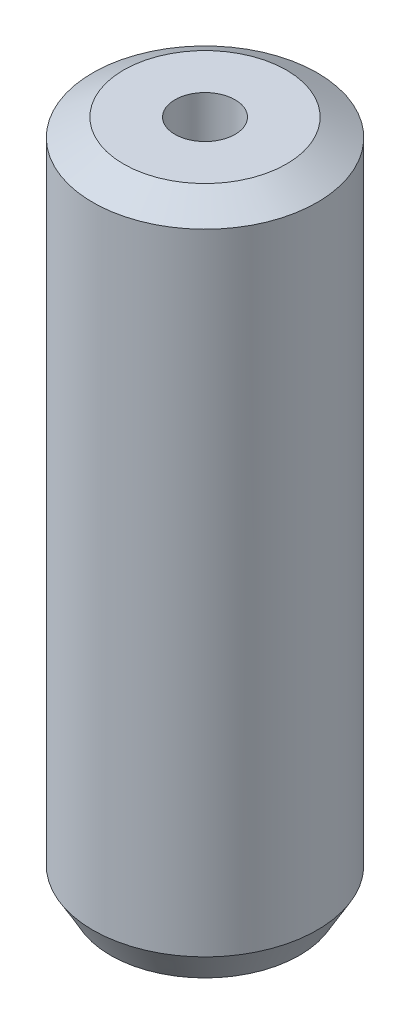
ISO-10303-21;
HEADER;
FILE_DESCRIPTION(('STEP AP214'),'2;1');
FILE_NAME('part.step','',(''),(''),'','','');
FILE_SCHEMA(('AUTOMOTIVE_DESIGN { 1 0 10303 214 1 1 1 1 }'));
ENDSEC;
DATA;
#1=APPLICATION_CONTEXT('core data for automotive mechanical design processes');
#2=APPLICATION_PROTOCOL_DEFINITION('international standard','automotive_design',2000,#1);
#3=PRODUCT_CONTEXT('',#1,'mechanical');
#4=PRODUCT('Part','Part','',(#3));
#5=PRODUCT_RELATED_PRODUCT_CATEGORY('part','',(#4));
#6=PRODUCT_DEFINITION_FORMATION('','',#4);
#7=PRODUCT_DEFINITION_CONTEXT('part definition',#1,'design');
#8=PRODUCT_DEFINITION('design','',#6,#7);
#9=PRODUCT_DEFINITION_SHAPE('','',#8);
#10=(LENGTH_UNIT() NAMED_UNIT(*) SI_UNIT(.MILLI.,.METRE.));
#11=(NAMED_UNIT(*) PLANE_ANGLE_UNIT() SI_UNIT($,.RADIAN.));
#12=(NAMED_UNIT(*) SI_UNIT($,.STERADIAN.) SOLID_ANGLE_UNIT());
#13=UNCERTAINTY_MEASURE_WITH_UNIT(LENGTH_MEASURE(1.E-05),#10,'distance_accuracy_value','');
#14=(GEOMETRIC_REPRESENTATION_CONTEXT(3) GLOBAL_UNCERTAINTY_ASSIGNED_CONTEXT((#13)) GLOBAL_UNIT_ASSIGNED_CONTEXT((#10,
#11,#12)) REPRESENTATION_CONTEXT('',''));
#15=CARTESIAN_POINT('',(0.,0.,0.));
#16=DIRECTION('',(0.,0.,1.));
#17=DIRECTION('',(1.,0.,0.));
#18=AXIS2_PLACEMENT_3D('',#15,#16,#17);
#19=CARTESIAN_POINT('',(0.,30.2308091959277,0.));
#20=DIRECTION('',(0.,-1.,0.));
#21=DIRECTION('',(0.,0.,-1.));
#22=AXIS2_PLACEMENT_3D('',#19,#20,#21);
#23=CYLINDRICAL_SURFACE('',#22,5.);
#24=CARTESIAN_POINT('',(0.,29.4384615355566,0.));
#25=DIRECTION('',(0.,1.,0.));
#26=DIRECTION('',(0.,0.,1.));
#27=AXIS2_PLACEMENT_3D('',#24,#25,#26);
#28=CIRCLE('',#27,5.);
#29=CARTESIAN_POINT('',(0.,29.4384615355566,-5.));
#30=VERTEX_POINT('',#29);
#31=EDGE_CURVE('E50',#30,#30,#28,.F.);
#32=CARTESIAN_POINT('',(0.,1.37238640502118,0.));
#33=DIRECTION('',(0.,1.,0.));
#34=DIRECTION('',(0.,0.,1.));
#35=AXIS2_PLACEMENT_3D('',#32,#33,#34);
#36=CIRCLE('',#35,5.);
#37=CARTESIAN_POINT('',(0.,1.37238640502117,-5.));
#38=VERTEX_POINT('',#37);
#39=EDGE_CURVE('E51',#38,#38,#36,.T.);
#40=CARTESIAN_POINT('',(0.,29.4384615355566,-5.));
#41=CARTESIAN_POINT('',(0.,29.1461065862801,-5.));
#42=CARTESIAN_POINT('',(0.,28.8537516370037,-5.));
#43=CARTESIAN_POINT('',(0.,28.2690417384509,-5.));
#44=CARTESIAN_POINT('',(0.,27.9766867891745,-5.));
#45=CARTESIAN_POINT('',(0.,27.3919768906217,-5.));
#46=CARTESIAN_POINT('',(0.,27.0996219413453,-5.));
#47=CARTESIAN_POINT('',(0.,26.5149120427925,-5.));
#48=CARTESIAN_POINT('',(0.,26.222557093516,-5.));
#49=CARTESIAN_POINT('',(0.,25.6378471949632,-5.));
#50=CARTESIAN_POINT('',(0.,25.3454922456868,-5.));
#51=CARTESIAN_POINT('',(0.,24.760782347134,-5.));
#52=CARTESIAN_POINT('',(0.,24.4684273978576,-5.));
#53=CARTESIAN_POINT('',(0.,23.8837174993048,-5.));
#54=CARTESIAN_POINT('',(0.,23.5913625500284,-5.));
#55=CARTESIAN_POINT('',(0.,23.0066526514755,-5.));
#56=CARTESIAN_POINT('',(0.,22.7142977021991,-5.));
#57=CARTESIAN_POINT('',(0.,22.1295878036463,-5.));
#58=CARTESIAN_POINT('',(0.,21.8372328543699,-5.));
#59=CARTESIAN_POINT('',(0.,21.2525229558171,-5.));
#60=CARTESIAN_POINT('',(0.,20.9601680065407,-5.));
#61=CARTESIAN_POINT('',(0.,20.3754581079878,-5.));
#62=CARTESIAN_POINT('',(0.,20.0831031587114,-5.));
#63=CARTESIAN_POINT('',(0.,19.4983932601586,-5.));
#64=CARTESIAN_POINT('',(0.,19.2060383108822,-5.));
#65=CARTESIAN_POINT('',(0.,18.6213284123294,-5.));
#66=CARTESIAN_POINT('',(0.,18.328973463053,-5.));
#67=CARTESIAN_POINT('',(0.,17.7442635645001,-5.));
#68=CARTESIAN_POINT('',(0.,17.4519086152237,-5.));
#69=CARTESIAN_POINT('',(0.,16.8671987166709,-5.));
#70=CARTESIAN_POINT('',(0.,16.5748437673945,-5.));
#71=CARTESIAN_POINT('',(0.,15.9901338688417,-5.));
#72=CARTESIAN_POINT('',(0.,15.6977789195653,-5.));
#73=CARTESIAN_POINT('',(0.,15.1130690210125,-5.));
#74=CARTESIAN_POINT('',(0.,14.820714071736,-5.));
#75=CARTESIAN_POINT('',(0.,14.2360041731832,-5.));
#76=CARTESIAN_POINT('',(0.,13.9436492239068,-5.));
#77=CARTESIAN_POINT('',(0.,13.358939325354,-5.));
#78=CARTESIAN_POINT('',(0.,13.0665843760776,-5.));
#79=CARTESIAN_POINT('',(0.,12.4818744775248,-5.));
#80=CARTESIAN_POINT('',(0.,12.1895195282484,-5.));
#81=CARTESIAN_POINT('',(0.,11.6048096296955,-5.));
#82=CARTESIAN_POINT('',(0.,11.3124546804191,-5.));
#83=CARTESIAN_POINT('',(0.,10.7277447818663,-5.));
#84=CARTESIAN_POINT('',(0.,10.4353898325899,-5.));
#85=CARTESIAN_POINT('',(0.,9.85067993403707,-5.));
#86=CARTESIAN_POINT('',(0.,9.55832498476066,-5.));
#87=CARTESIAN_POINT('',(0.,8.97361508620784,-5.));
#88=CARTESIAN_POINT('',(0.,8.68126013693143,-5.));
#89=CARTESIAN_POINT('',(0.,8.09655023837861,-5.));
#90=CARTESIAN_POINT('',(0.,7.8041952891022,-5.));
#91=CARTESIAN_POINT('',(0.,7.21948539054938,-5.));
#92=CARTESIAN_POINT('',(0.,6.92713044127297,-5.));
#93=CARTESIAN_POINT('',(0.,6.34242054272015,-5.));
#94=CARTESIAN_POINT('',(0.,6.05006559344374,-5.));
#95=CARTESIAN_POINT('',(0.,5.46535569489092,-5.));
#96=CARTESIAN_POINT('',(0.,5.17300074561451,-5.));
#97=CARTESIAN_POINT('',(0.,4.58829084706169,-5.));
#98=CARTESIAN_POINT('',(0.,4.29593589778527,-5.));
#99=CARTESIAN_POINT('',(0.,3.71122599923245,-5.));
#100=CARTESIAN_POINT('',(0.,3.41887104995604,-5.));
#101=CARTESIAN_POINT('',(0.,2.83416115140322,-5.));
#102=CARTESIAN_POINT('',(0.,2.54180620212681,-5.));
#103=CARTESIAN_POINT('',(0.,1.95709630357399,-5.));
#104=CARTESIAN_POINT('',(0.,1.66474135429758,-5.));
#105=CARTESIAN_POINT('',(0.,1.37238640502117,-5.));
#106=B_SPLINE_CURVE_WITH_KNOTS('',3,(#40,#41,#42,#43,#44,#45,#46,#47,#48,#49,#50,#51,#52,#53,
#54,#55,#56,#57,#58,#59,#60,#61,#62,#63,#64,#65,#66,#67,#68,#69,#70,#71,#72,#73,#74,#75,#76,#77,
#78,#79,#80,#81,#82,#83,#84,#85,#86,#87,#88,#89,#90,#91,#92,#93,#94,#95,#96,#97,#98,#99,#100,
#101,#102,#103,#104,#105),.UNSPECIFIED.,.F.,.F.,(4,2,2,2,2,2,2,2,2,2,2,2,2,2,2,2,2,2,2,2,2,2,2,
2,2,2,2,2,2,2,2,2,4),(0.,0.877064847829231,1.75412969565846,2.63119454348769,3.50825939131692,
4.38532423914615,5.26238908697538,6.13945393480461,7.01651878263384,7.89358363046307,
8.7706484782923,9.64771332612153,10.5247781739508,11.40184302178,12.2789078696092,
13.1559727174385,14.0330375652677,14.9101024130969,15.7871672609262,16.6642321087554,
17.5412969565846,18.4183618044138,19.2954266522431,20.1724915000723,21.0495563479015,
21.9266211957308,22.80368604356,23.6807508913892,24.5578157392185,25.4348805870477,
26.3119454348769,27.1890102827061,28.0660751305354),.UNSPECIFIED.);
#107=EDGE_CURVE('BSEAM39',#30,#38,#106,.T.);
#108=ORIENTED_EDGE('',*,*,#31,.T.);
#109=ORIENTED_EDGE('',*,*,#39,.T.);
#110=ORIENTED_EDGE('',*,*,#107,.T.);
#111=ORIENTED_EDGE('',*,*,#107,.F.);
#112=EDGE_LOOP('',(#108,#110,#109,#111));
#113=FACE_BOUND('',#112,.T.);
#114=ADVANCED_FACE('F39',(#113),#23,.T.);
#115=CARTESIAN_POINT('',(0.,30.2308091959277,0.));
#116=DIRECTION('',(0.,1.,0.));
#117=DIRECTION('',(0.,0.,1.));
#118=AXIS2_PLACEMENT_3D('',#115,#116,#117);
#119=PLANE('',#118);
#120=CARTESIAN_POINT('',(0.,30.2308091959277,0.));
#121=DIRECTION('',(0.,1.,0.));
#122=DIRECTION('',(0.,0.,1.));
#123=AXIS2_PLACEMENT_3D('',#120,#121,#122);
#124=CIRCLE('',#123,3.62761359497888);
#125=CARTESIAN_POINT('',(0.,30.2308091959277,3.62761359497888));
#126=VERTEX_POINT('',#125);
#127=EDGE_CURVE('E54',#126,#126,#124,.T.);
#128=ORIENTED_EDGE('',*,*,#127,.T.);
#129=EDGE_LOOP('',(#128));
#130=FACE_BOUND('',#129,.T.);
#131=CARTESIAN_POINT('',(0.,30.2308091959277,0.));
#132=DIRECTION('',(0.,1.,0.));
#133=DIRECTION('',(0.,0.,1.));
#134=AXIS2_PLACEMENT_3D('',#131,#132,#133);
#135=CIRCLE('',#134,1.33860655335828);
#136=CARTESIAN_POINT('',(0.,30.2308091959277,-1.33860655335828));
#137=VERTEX_POINT('',#136);
#138=EDGE_CURVE('E58',#137,#137,#135,.T.);
#139=ORIENTED_EDGE('',*,*,#138,.F.);
#140=EDGE_LOOP('',(#139));
#141=FACE_BOUND('',#140,.T.);
#142=ADVANCED_FACE('F69',(#130,#141),#119,.T.);
#143=CARTESIAN_POINT('',(0.,0.,0.));
#144=DIRECTION('',(0.,1.,0.));
#145=DIRECTION('',(0.,0.,1.));
#146=AXIS2_PLACEMENT_3D('',#143,#144,#145);
#147=PLANE('',#146);
#148=CARTESIAN_POINT('',(0.,0.,0.));
#149=DIRECTION('',(0.,1.,0.));
#150=DIRECTION('',(0.,0.,1.));
#151=AXIS2_PLACEMENT_3D('',#148,#149,#150);
#152=CIRCLE('',#151,4.20765233962883);
#153=CARTESIAN_POINT('',(0.,0.,4.20765233962883));
#154=VERTEX_POINT('',#153);
#155=EDGE_CURVE('E10',#154,#154,#152,.F.);
#156=ORIENTED_EDGE('',*,*,#155,.T.);
#157=EDGE_LOOP('',(#156));
#158=FACE_BOUND('',#157,.T.);
#159=CARTESIAN_POINT('',(0.,0.,0.));
#160=DIRECTION('',(0.,1.,0.));
#161=DIRECTION('',(0.,0.,1.));
#162=AXIS2_PLACEMENT_3D('',#159,#160,#161);
#163=CIRCLE('',#162,1.33860655335828);
#164=CARTESIAN_POINT('',(0.,0.,-1.33860655335828));
#165=VERTEX_POINT('',#164);
#166=EDGE_CURVE('E63',#165,#165,#163,.T.);
#167=ORIENTED_EDGE('',*,*,#166,.T.);
#168=EDGE_LOOP('',(#167));
#169=FACE_BOUND('',#168,.T.);
#170=ADVANCED_FACE('F75',(#158,#169),#147,.F.);
#171=CARTESIAN_POINT('',(0.,30.2308091959277,0.));
#172=DIRECTION('',(0.,-1.,0.));
#173=DIRECTION('',(0.,0.,-1.));
#174=AXIS2_PLACEMENT_3D('',#171,#172,#173);
#175=CYLINDRICAL_SURFACE('',#174,1.33860655335828);
#176=CARTESIAN_POINT('',(0.,30.2308091959277,-1.33860655335828));
#177=CARTESIAN_POINT('',(0.,29.9159049334701,-1.33860655335828));
#178=CARTESIAN_POINT('',(0.,29.6010006710125,-1.33860655335828));
#179=CARTESIAN_POINT('',(0.,28.9711921460974,-1.33860655335828));
#180=CARTESIAN_POINT('',(0.,28.6562878836398,-1.33860655335828));
#181=CARTESIAN_POINT('',(0.,28.0264793587246,-1.33860655335828));
#182=CARTESIAN_POINT('',(0.,27.711575096267,-1.33860655335828));
#183=CARTESIAN_POINT('',(0.,27.0817665713519,-1.33860655335828));
#184=CARTESIAN_POINT('',(0.,26.7668623088943,-1.33860655335828));
#185=CARTESIAN_POINT('',(0.,26.1370537839791,-1.33860655335828));
#186=CARTESIAN_POINT('',(0.,25.8221495215216,-1.33860655335828));
#187=CARTESIAN_POINT('',(0.,25.1923409966064,-1.33860655335828));
#188=CARTESIAN_POINT('',(0.,24.8774367341488,-1.33860655335828));
#189=CARTESIAN_POINT('',(0.,24.2476282092337,-1.33860655335828));
#190=CARTESIAN_POINT('',(0.,23.9327239467761,-1.33860655335828));
#191=CARTESIAN_POINT('',(0.,23.3029154218609,-1.33860655335828));
#192=CARTESIAN_POINT('',(0.,22.9880111594033,-1.33860655335828));
#193=CARTESIAN_POINT('',(0.,22.3582026344882,-1.33860655335828));
#194=CARTESIAN_POINT('',(0.,22.0432983720306,-1.33860655335828));
#195=CARTESIAN_POINT('',(0.,21.4134898471154,-1.33860655335828));
#196=CARTESIAN_POINT('',(0.,21.0985855846579,-1.33860655335828));
#197=CARTESIAN_POINT('',(0.,20.4687770597427,-1.33860655335828));
#198=CARTESIAN_POINT('',(0.,20.1538727972851,-1.33860655335828));
#199=CARTESIAN_POINT('',(0.,19.52406427237,-1.33860655335828));
#200=CARTESIAN_POINT('',(0.,19.2091600099124,-1.33860655335828));
#201=CARTESIAN_POINT('',(0.,18.5793514849972,-1.33860655335828));
#202=CARTESIAN_POINT('',(0.,18.2644472225396,-1.33860655335828));
#203=CARTESIAN_POINT('',(0.,17.6346386976245,-1.33860655335828));
#204=CARTESIAN_POINT('',(0.,17.3197344351669,-1.33860655335828));
#205=CARTESIAN_POINT('',(0.,16.6899259102517,-1.33860655335828));
#206=CARTESIAN_POINT('',(0.,16.3750216477942,-1.33860655335828));
#207=CARTESIAN_POINT('',(0.,15.745213122879,-1.33860655335828));
#208=CARTESIAN_POINT('',(0.,15.4303088604214,-1.33860655335828));
#209=CARTESIAN_POINT('',(0.,14.8005003355063,-1.33860655335828));
#210=CARTESIAN_POINT('',(0.,14.4855960730487,-1.33860655335828));
#211=CARTESIAN_POINT('',(0.,13.8557875481335,-1.33860655335828));
#212=CARTESIAN_POINT('',(0.,13.5408832856759,-1.33860655335828));
#213=CARTESIAN_POINT('',(0.,12.9110747607608,-1.33860655335828));
#214=CARTESIAN_POINT('',(0.,12.5961704983032,-1.33860655335828));
#215=CARTESIAN_POINT('',(0.,11.966361973388,-1.33860655335828));
#216=CARTESIAN_POINT('',(0.,11.6514577109305,-1.33860655335828));
#217=CARTESIAN_POINT('',(0.,11.0216491860153,-1.33860655335828));
#218=CARTESIAN_POINT('',(0.,10.7067449235577,-1.33860655335828));
#219=CARTESIAN_POINT('',(0.,10.0769363986426,-1.33860655335828));
#220=CARTESIAN_POINT('',(0.,9.76203213618498,-1.33860655335828));
#221=CARTESIAN_POINT('',(0.,9.13222361126982,-1.33860655335828));
#222=CARTESIAN_POINT('',(0.,8.81731934881224,-1.33860655335828));
#223=CARTESIAN_POINT('',(0.,8.18751082389708,-1.33860655335828));
#224=CARTESIAN_POINT('',(0.,7.8726065614395,-1.33860655335828));
#225=CARTESIAN_POINT('',(0.,7.24279803652434,-1.33860655335828));
#226=CARTESIAN_POINT('',(0.,6.92789377406676,-1.33860655335828));
#227=CARTESIAN_POINT('',(0.,6.2980852491516,-1.33860655335828));
#228=CARTESIAN_POINT('',(0.,5.98318098669402,-1.33860655335828));
#229=CARTESIAN_POINT('',(0.,5.35337246177886,-1.33860655335828));
#230=CARTESIAN_POINT('',(0.,5.03846819932128,-1.33860655335828));
#231=CARTESIAN_POINT('',(0.,4.40865967440612,-1.33860655335828));
#232=CARTESIAN_POINT('',(0.,4.09375541194854,-1.33860655335828));
#233=CARTESIAN_POINT('',(0.,3.46394688703338,-1.33860655335828));
#234=CARTESIAN_POINT('',(0.,3.1490426245758,-1.33860655335828));
#235=CARTESIAN_POINT('',(0.,2.51923409966064,-1.33860655335828));
#236=CARTESIAN_POINT('',(0.,2.20432983720306,-1.33860655335828));
#237=CARTESIAN_POINT('',(0.,1.5745213122879,-1.33860655335828));
#238=CARTESIAN_POINT('',(0.,1.25961704983032,-1.33860655335828));
#239=CARTESIAN_POINT('',(0.,0.62980852491516,-1.33860655335828));
#240=CARTESIAN_POINT('',(0.,0.31490426245758,-1.33860655335828));
#241=CARTESIAN_POINT('',(0.,0.,-1.33860655335828));
#242=B_SPLINE_CURVE_WITH_KNOTS('',3,(#176,#177,#178,#179,#180,#181,#182,#183,#184,#185,#186,
#187,#188,#189,#190,#191,#192,#193,#194,#195,#196,#197,#198,#199,#200,#201,#202,#203,#204,#205,
#206,#207,#208,#209,#210,#211,#212,#213,#214,#215,#216,#217,#218,#219,#220,#221,#222,#223,#224,
#225,#226,#227,#228,#229,#230,#231,#232,#233,#234,#235,#236,#237,#238,#239,#240,#241),
.UNSPECIFIED.,.F.,.F.,(4,2,2,2,2,2,2,2,2,2,2,2,2,2,2,2,2,2,2,2,2,2,2,2,2,2,2,2,2,2,2,2,4),(0.,
0.944712787372737,1.88942557474548,2.83413836211822,3.77885114949096,4.7235639368637,
5.66827672423644,6.61298951160918,7.55770229898192,8.50241508635466,9.4471278737274,
10.3918406611001,11.3365534484729,12.2812662358456,13.2259790232184,14.1706918105911,
15.1154045979638,16.0601173853366,17.0048301727093,17.9495429600821,18.8942557474548,
19.8389685348275,20.7836813222003,21.728394109573,22.6731068969458,23.6178196843185,
24.5625324716912,25.507245259064,26.4519580464367,27.3966708338095,28.3413836211822,
29.2860964085549,30.2308091959277),.UNSPECIFIED.);
#243=EDGE_CURVE('BSEAM70',#137,#165,#242,.T.);
#244=ORIENTED_EDGE('',*,*,#138,.T.);
#245=ORIENTED_EDGE('',*,*,#166,.F.);
#246=ORIENTED_EDGE('',*,*,#243,.T.);
#247=ORIENTED_EDGE('',*,*,#243,.F.);
#248=EDGE_LOOP('',(#244,#246,#245,#247));
#249=FACE_BOUND('',#248,.T.);
#250=ADVANCED_FACE('F70',(#249),#175,.F.);
#251=CARTESIAN_POINT('',(0.,30.2308091959277,0.));
#252=DIRECTION('',(0.,-1.,0.));
#253=DIRECTION('',(0.,0.,-1.));
#254=AXIS2_PLACEMENT_3D('',#251,#252,#253);
#255=CONICAL_SURFACE('',#254,3.62761359497888,1.0471975511966);
#256=ORIENTED_EDGE('',*,*,#31,.F.);
#257=EDGE_LOOP('',(#256));
#258=FACE_BOUND('',#257,.T.);
#259=ORIENTED_EDGE('',*,*,#127,.F.);
#260=EDGE_LOOP('',(#259));
#261=FACE_BOUND('',#260,.T.);
#262=ADVANCED_FACE('F81',(#258,#261),#255,.T.);
#263=CARTESIAN_POINT('',(0.,1.37238640502118,0.));
#264=DIRECTION('',(0.,1.,0.));
#265=DIRECTION('',(0.,0.,1.));
#266=AXIS2_PLACEMENT_3D('',#263,#264,#265);
#267=CONICAL_SURFACE('',#266,5.,0.523598775598304);
#268=ORIENTED_EDGE('',*,*,#155,.F.);
#269=EDGE_LOOP('',(#268));
#270=FACE_BOUND('',#269,.T.);
#271=ORIENTED_EDGE('',*,*,#39,.F.);
#272=EDGE_LOOP('',(#271));
#273=FACE_BOUND('',#272,.T.);
#274=ADVANCED_FACE('F45',(#270,#273),#267,.T.);
#275=CLOSED_SHELL('',(#114,#142,#170,#250,#262,#274));
#276=MANIFOLD_SOLID_BREP('B2',#275);
#277=ADVANCED_BREP_SHAPE_REPRESENTATION('',(#18,#276),#14);
#278=SHAPE_DEFINITION_REPRESENTATION(#9,#277);
ENDSEC;
END-ISO-10303-21;
